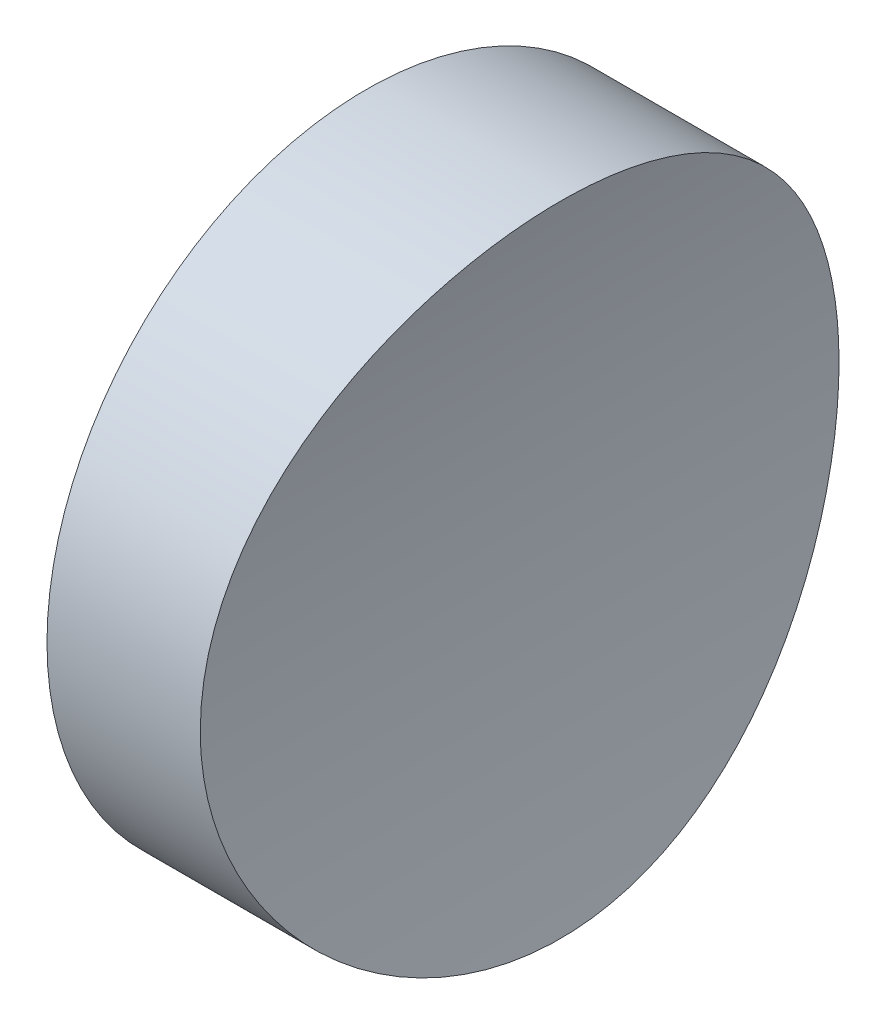
ISO-10303-21;
HEADER;
FILE_DESCRIPTION(('STEP AP214'),'2;1');
FILE_NAME('part.step','',(''),(''),'','','');
FILE_SCHEMA(('AUTOMOTIVE_DESIGN { 1 0 10303 214 1 1 1 1 }'));
ENDSEC;
DATA;
#1=APPLICATION_CONTEXT('core data for automotive mechanical design processes');
#2=APPLICATION_PROTOCOL_DEFINITION('international standard','automotive_design',2000,#1);
#3=PRODUCT_CONTEXT('',#1,'mechanical');
#4=PRODUCT('Part','Part','',(#3));
#5=PRODUCT_RELATED_PRODUCT_CATEGORY('part','',(#4));
#6=PRODUCT_DEFINITION_FORMATION('','',#4);
#7=PRODUCT_DEFINITION_CONTEXT('part definition',#1,'design');
#8=PRODUCT_DEFINITION('design','',#6,#7);
#9=PRODUCT_DEFINITION_SHAPE('','',#8);
#10=(LENGTH_UNIT() NAMED_UNIT(*) SI_UNIT(.MILLI.,.METRE.));
#11=(NAMED_UNIT(*) PLANE_ANGLE_UNIT() SI_UNIT($,.RADIAN.));
#12=(NAMED_UNIT(*) SI_UNIT($,.STERADIAN.) SOLID_ANGLE_UNIT());
#13=UNCERTAINTY_MEASURE_WITH_UNIT(LENGTH_MEASURE(1.E-05),#10,'distance_accuracy_value','');
#14=(GEOMETRIC_REPRESENTATION_CONTEXT(3) GLOBAL_UNCERTAINTY_ASSIGNED_CONTEXT((#13)) GLOBAL_UNIT_ASSIGNED_CONTEXT((#10,
#11,#12)) REPRESENTATION_CONTEXT('',''));
#15=CARTESIAN_POINT('',(0.,0.,0.));
#16=DIRECTION('',(0.,0.,1.));
#17=DIRECTION('',(1.,0.,0.));
#18=AXIS2_PLACEMENT_3D('',#15,#16,#17);
#19=CARTESIAN_POINT('',(10.,0.,0.));
#20=DIRECTION('',(-1.,0.,0.));
#21=DIRECTION('',(0.,0.,1.));
#22=AXIS2_PLACEMENT_3D('',#19,#20,#21);
#23=CYLINDRICAL_SURFACE('',#22,12.5);
#24=CARTESIAN_POINT('',(5.99999999999998,0.,12.5));
#25=CARTESIAN_POINT('',(6.00000081571526,0.345345858129955,12.499998542476));
#26=CARTESIAN_POINT('',(6.00358682191483,0.690720980627794,12.4856762712683));
#27=CARTESIAN_POINT('',(6.0178337178756,1.37897685436808,12.4285034438653));
#28=CARTESIAN_POINT('',(6.02849541484255,1.7218573165034,12.3856496327458));
#29=CARTESIAN_POINT('',(6.05660479370948,2.40280021913144,12.2717468283778));
#30=CARTESIAN_POINT('',(6.07405591791563,2.74086012527902,12.2006835322718));
#31=CARTESIAN_POINT('',(6.11526221735483,3.40956959119171,12.0309531087511));
#32=CARTESIAN_POINT('',(6.13901723144404,3.74021934014551,11.932286686941));
#33=CARTESIAN_POINT('',(6.19214986155646,4.39143160454447,11.7082770348339));
#34=CARTESIAN_POINT('',(6.22152060794816,4.71200589293533,11.5829663772143));
#35=CARTESIAN_POINT('',(6.28511099408943,5.34133409076771,11.3065586325392));
#36=CARTESIAN_POINT('',(6.31933065951727,5.65008793760106,11.1554614089257));
#37=CARTESIAN_POINT('',(6.39170415451126,6.25375145648697,10.8285920771972));
#38=CARTESIAN_POINT('',(6.42985792711309,6.54866132890482,10.6528203263462));
#39=CARTESIAN_POINT('',(6.50909045411966,7.1227706440562,10.2778258129714));
#40=CARTESIAN_POINT('',(6.55016933737079,7.40196939376919,10.0786020171701));
#41=CARTESIAN_POINT('',(6.6349442037592,7.94789184610699,9.65415754429416));
#42=CARTESIAN_POINT('',(6.67867452090326,8.21428968409248,9.42852450106898));
#43=CARTESIAN_POINT('',(6.76684843513978,8.7272289784513,8.95584237426211));
#44=CARTESIAN_POINT('',(6.81129204065602,8.97377020011486,8.70879303760655));
#45=CARTESIAN_POINT('',(6.89967618780297,9.44541093088348,8.19486829551772));
#46=CARTESIAN_POINT('',(6.94361666645053,9.67050778077715,7.92799043853142));
#47=CARTESIAN_POINT('',(7.02976701673763,10.097711498905,7.37617587363527));
#48=CARTESIAN_POINT('',(7.07197693308795,10.2998189613326,7.09123963276649));
#49=CARTESIAN_POINT('',(7.15408511333619,10.6824846765056,6.50077864948295));
#50=CARTESIAN_POINT('',(7.19393952525632,10.8626766877929,6.19501027061268));
#51=CARTESIAN_POINT('',(7.26946059783892,11.1965999199108,5.56884605054303));
#52=CARTESIAN_POINT('',(7.30512720563418,11.3503308067052,5.24845002475386));
#53=CARTESIAN_POINT('',(7.37118847932654,11.6301059024363,4.59530579606809));
#54=CARTESIAN_POINT('',(7.40158380092712,11.7561535554537,4.26255913574648));
#55=CARTESIAN_POINT('',(7.45616647580187,11.9795435842076,3.58707023733103));
#56=CARTESIAN_POINT('',(7.48035397777611,12.0768866475326,3.24432823888125));
#57=CARTESIAN_POINT('',(7.52134308881477,12.2403753433022,2.55832805448346));
#58=CARTESIAN_POINT('',(7.53828292669337,12.3071067781999,2.21521770157624));
#59=CARTESIAN_POINT('',(7.56494584700391,12.4116255097281,1.52433762999713));
#60=CARTESIAN_POINT('',(7.57466901692549,12.4494131572523,1.17656796786334));
#61=CARTESIAN_POINT('',(7.58659428826142,12.4957081162939,0.479005845104437));
#62=CARTESIAN_POINT('',(7.58879745752279,12.5042195850568,0.12921367874362));
#63=CARTESIAN_POINT('',(7.58561640729568,12.4918975051369,-0.56981600901988));
#64=CARTESIAN_POINT('',(7.58023229330772,12.4710643644883,-0.919053538067147));
#65=CARTESIAN_POINT('',(7.5622673007123,12.4011011342675,-1.60591279143432));
#66=CARTESIAN_POINT('',(7.54986430999014,12.3526702834176,-1.94361068244322));
#67=CARTESIAN_POINT('',(7.51836444125059,12.2284550484748,-2.61361187278367));
#68=CARTESIAN_POINT('',(7.49926768776225,12.1526711732496,-2.94591527235263));
#69=CARTESIAN_POINT('',(7.45493666995216,11.9743582368255,-3.60285956314226));
#70=CARTESIAN_POINT('',(7.42970210605493,11.8718278701608,-3.92750007950268));
#71=CARTESIAN_POINT('',(7.37381964363987,11.6408201249125,-4.56693246540194));
#72=CARTESIAN_POINT('',(7.34317165986572,11.5123423376766,-4.8817241797394));
#73=CARTESIAN_POINT('',(7.27699176787775,11.2289731703879,-5.50252257587502));
#74=CARTESIAN_POINT('',(7.24141376338958,11.0738287052328,-5.80840878938925));
#75=CARTESIAN_POINT('',(7.16661195870226,10.7391618403495,-6.4060680089994));
#76=CARTESIAN_POINT('',(7.12738814504062,10.5596393506019,-6.69784096297475));
#77=CARTESIAN_POINT('',(7.04636692306731,10.1774241513362,-7.26547516607328));
#78=CARTESIAN_POINT('',(7.00456913925823,9.97472805748094,-7.54133408219258));
#79=CARTESIAN_POINT('',(6.91953341842233,9.54752439698663,-8.07537681044579));
#80=CARTESIAN_POINT('',(6.87629545355465,9.32301640852998,-8.33356028059175));
#81=CARTESIAN_POINT('',(6.78829171801662,8.84692110492471,-8.83773744641804));
#82=CARTESIAN_POINT('',(6.74351756411468,8.59474378950227,-9.08317289987925));
#83=CARTESIAN_POINT('',(6.65491293081792,8.07050421758106,-9.551995703129));
#84=CARTESIAN_POINT('',(6.61108246987495,7.79844157272413,-9.77538262211187));
#85=CARTESIAN_POINT('',(6.52558221368867,7.23621606208977,-10.1985771706933));
#86=CARTESIAN_POINT('',(6.48391250306027,6.94605248845918,-10.3983838772818));
#87=CARTESIAN_POINT('',(6.4038956615231,6.34956444270317,-10.772978157784));
#88=CARTESIAN_POINT('',(6.3655485103532,6.04324006914541,-10.947765884269));
#89=CARTESIAN_POINT('',(6.2931243100662,5.41541235056755,-11.2715789798304));
#90=CARTESIAN_POINT('',(6.25906253004677,5.09386005140018,-11.4205129077416));
#91=CARTESIAN_POINT('',(6.19633357277247,4.43881192206135,-11.6907000644577));
#92=CARTESIAN_POINT('',(6.16766642582519,4.10531602480211,-11.8119531377496));
#93=CARTESIAN_POINT('',(6.11655467999221,3.42883552948264,-12.0257598474396));
#94=CARTESIAN_POINT('',(6.09410911269256,3.08585241729649,-12.1183179505915));
#95=CARTESIAN_POINT('',(6.05608680584867,2.39289058593558,-12.2739631052046));
#96=CARTESIAN_POINT('',(6.04050989696111,2.04291203945215,-12.3370508832442));
#97=CARTESIAN_POINT('',(6.01698513491397,1.34763092374324,-12.4319680906689));
#98=CARTESIAN_POINT('',(6.00885216046332,1.00243806174492,-12.4645564950301));
#99=CARTESIAN_POINT('',(5.99976653673325,0.310446227793141,-12.5009464008154));
#100=CARTESIAN_POINT('',(5.99881376495821,-0.0363527166592359,-12.5047483933412));
#101=CARTESIAN_POINT('',(6.00411496567777,-0.72898221080777,-12.4835341096494));
#102=CARTESIAN_POINT('',(6.01036834064533,-1.07481283841245,-12.458520222818));
#103=CARTESIAN_POINT('',(6.02990580468649,-1.76300446713083,-12.3798934330572));
#104=CARTESIAN_POINT('',(6.04318986627077,-2.10536548180506,-12.3262806419468));
#105=CARTESIAN_POINT('',(6.07617113727906,-2.77909750176338,-12.1919176524651));
#106=CARTESIAN_POINT('',(6.09577015058952,-3.11055621416769,-12.1115824000743));
#107=CARTESIAN_POINT('',(6.14090559926788,-3.76542622915844,-11.9242422256603));
#108=CARTESIAN_POINT('',(6.16644195797631,-4.08883763558724,-11.8172376479743));
#109=CARTESIAN_POINT('',(6.22277602725349,-4.72547495684811,-11.5773748413572));
#110=CARTESIAN_POINT('',(6.25357412556555,-5.03870011901852,-11.4445147070017));
#111=CARTESIAN_POINT('',(6.31962082142066,-5.65290579173548,-11.1539268996522));
#112=CARTESIAN_POINT('',(6.3548695011266,-5.95388607609178,-10.996198767553));
#113=CARTESIAN_POINT('',(6.4295561565498,-6.54690733138469,-10.6539790694276));
#114=CARTESIAN_POINT('',(6.46905735166861,-6.83869503605042,-10.4690623992547));
#115=CARTESIAN_POINT('',(6.55066028924347,-7.40573208883362,-10.075919856371));
#116=CARTESIAN_POINT('',(6.59276205693865,-7.68098127638992,-9.86769375742107));
#117=CARTESIAN_POINT('',(6.67844828018092,-8.21323439402229,-9.42929844928364));
#118=CARTESIAN_POINT('',(6.72203296020064,-8.47023554350212,-9.19912590841092));
#119=CARTESIAN_POINT('',(6.80951322579715,-8.96431645792168,-8.71836265750537));
#120=CARTESIAN_POINT('',(6.85340881488648,-9.20139599740279,-8.46777171645481));
#121=CARTESIAN_POINT('',(6.94139799399648,-9.65967669367524,-7.94137233363743));
#122=CARTESIAN_POINT('',(6.98546992868595,-9.8803443006733,-7.66509543686493));
#123=CARTESIAN_POINT('',(7.07143892969173,-10.2976362133889,-7.09461670037542));
#124=CARTESIAN_POINT('',(7.11333595631091,-10.494260080341,-6.8004145336935));
#125=CARTESIAN_POINT('',(7.19373479083822,-10.8620404955946,-6.19606290103677));
#126=CARTESIAN_POINT('',(7.23223667826019,-11.0331976403887,-5.88591380880689));
#127=CARTESIAN_POINT('',(7.3047025760101,-11.3487546890229,-5.25177939598629));
#128=CARTESIAN_POINT('',(7.33866664946515,-11.493154965098,-4.92779426795627));
#129=CARTESIAN_POINT('',(7.40083929542536,-11.7532704940522,-4.27023312528235));
#130=CARTESIAN_POINT('',(7.42908117765517,-11.8691526557657,-3.93672631797506));
#131=CARTESIAN_POINT('',(7.4791975052135,-12.0723939041458,-3.26065850705788));
#132=CARTESIAN_POINT('',(7.50107195946589,-12.1597530307871,-2.91809751613804));
#133=CARTESIAN_POINT('',(7.53776609513861,-12.3051825749983,-2.22650410200567));
#134=CARTESIAN_POINT('',(7.55258707103971,-12.363258366872,-1.87747287845977));
#135=CARTESIAN_POINT('',(7.57470929351593,-12.4496272042819,-1.17551084786422));
#136=CARTESIAN_POINT('',(7.58201072100792,-12.4779209663603,-0.822580134840995));
#137=CARTESIAN_POINT('',(7.58876272518206,-12.5040902755747,-0.125690563470842));
#138=CARTESIAN_POINT('',(7.5884329957858,-12.5028170258756,0.218234490431442));
#139=CARTESIAN_POINT('',(7.58047164049161,-12.4719496530419,0.904721133720535));
#140=CARTESIAN_POINT('',(7.57284016234521,-12.4423561029709,1.24728275055577));
#141=CARTESIAN_POINT('',(7.55050621633596,-12.3551031042829,1.92856624844879));
#142=CARTESIAN_POINT('',(7.53580393649118,-12.2974444019395,2.26728823136028));
#143=CARTESIAN_POINT('',(7.49976833730183,-12.1545443869924,2.93850126361318));
#144=CARTESIAN_POINT('',(7.47843498471599,-12.0693029361175,3.2709922817102));
#145=CARTESIAN_POINT('',(7.42991206645613,-11.872520891633,3.92547045749319));
#146=CARTESIAN_POINT('',(7.40275833107813,-11.7611408263901,4.24750858869969));
#147=CARTESIAN_POINT('',(7.34329675989242,-11.512668480082,4.88100719240879));
#148=CARTESIAN_POINT('',(7.31098896101167,-11.3755763832328,5.19246774067648));
#149=CARTESIAN_POINT('',(7.24211968532036,-11.0766699521319,5.80283282354663));
#150=CARTESIAN_POINT('',(7.20555779746464,-10.9148532284252,6.1017361410208));
#151=CARTESIAN_POINT('',(7.12918322582309,-10.567632405847,6.68508562882951));
#152=CARTESIAN_POINT('',(7.08937040800286,-10.3822273342624,6.96953120229244));
#153=CARTESIAN_POINT('',(7.00649618726664,-9.98393796386293,7.52941321165712));
#154=CARTESIAN_POINT('',(6.96337713500564,-9.77046302819968,7.80442110523206));
#155=CARTESIAN_POINT('',(6.87604107072134,-9.32142482529095,8.33558565405774));
#156=CARTESIAN_POINT('',(6.83182403911286,-9.08586116383034,8.59174197272076));
#157=CARTESIAN_POINT('',(6.74350537425833,-8.59419030433725,9.0835452974473));
#158=CARTESIAN_POINT('',(6.69940374245358,-8.33808285097161,9.31919204852711));
#159=CARTESIAN_POINT('',(6.61249908626096,-7.80686919956302,9.76851402919657));
#160=CARTESIAN_POINT('',(6.56969663457236,-7.53175479311293,9.98217966554263));
#161=CARTESIAN_POINT('',(6.48581888110867,-6.95924298273733,10.3896396759224));
#162=CARTESIAN_POINT('',(6.44478908380965,-6.66153155922842,10.5830025235865));
#163=CARTESIAN_POINT('',(6.36648149411774,-6.05050823274959,10.9438189871761));
#164=CARTESIAN_POINT('',(6.32920203316949,-5.73720336100236,11.1112841431721));
#165=CARTESIAN_POINT('',(6.25944836751581,-5.09716652663357,11.4190604869767));
#166=CARTESIAN_POINT('',(6.22697227968576,-4.7704398904413,11.5593823227875));
#167=CARTESIAN_POINT('',(6.16774393866742,-4.10578919609508,11.8118084302427));
#168=CARTESIAN_POINT('',(6.14099082211563,-3.7678668358159,11.9239169585779));
#169=CARTESIAN_POINT('',(6.09841212026126,-3.14787089764561,12.1005925818354));
#170=CARTESIAN_POINT('',(6.08147725793302,-2.86728001520345,12.1701379933195));
#171=CARTESIAN_POINT('',(6.05220539305691,-2.30172947899819,12.2896522930125));
#172=CARTESIAN_POINT('',(6.03986806976469,-2.01677013144286,12.339622546882));
#173=CARTESIAN_POINT('',(6.02003029288133,-1.44387788843724,12.4196972192842));
#174=CARTESIAN_POINT('',(6.01253030510685,-1.15594470933018,12.4497997246361));
#175=CARTESIAN_POINT('',(6.00251545766746,-0.578680949140916,12.4899491478882));
#176=CARTESIAN_POINT('',(5.9999993165465,-0.289350746448699,12.500001221198));
#177=CARTESIAN_POINT('',(5.99999999999998,0.,12.5));
#178=B_SPLINE_CURVE_WITH_KNOTS('',3,(#24,#25,#26,#27,#28,#29,#30,#31,#32,#33,#34,#35,#36,#37,
#38,#39,#40,#41,#42,#43,#44,#45,#46,#47,#48,#49,#50,#51,#52,#53,#54,#55,#56,#57,#58,#59,#60,#61,
#62,#63,#64,#65,#66,#67,#68,#69,#70,#71,#72,#73,#74,#75,#76,#77,#78,#79,#80,#81,#82,#83,#84,#85,
#86,#87,#88,#89,#90,#91,#92,#93,#94,#95,#96,#97,#98,#99,#100,#101,#102,#103,#104,#105,#106,#107,
#108,#109,#110,#111,#112,#113,#114,#115,#116,#117,#118,#119,#120,#121,#122,#123,#124,#125,#126,
#127,#128,#129,#130,#131,#132,#133,#134,#135,#136,#137,#138,#139,#140,#141,#142,#143,#144,#145,
#146,#147,#148,#149,#150,#151,#152,#153,#154,#155,#156,#157,#158,#159,#160,#161,#162,#163,#164,
#165,#166,#167,#168,#169,#170,#171,#172,#173,#174,#175,#176,#177),.UNSPECIFIED.,.T.,.F.,(4,2,2,
2,2,2,2,2,2,2,2,2,2,2,2,2,2,2,2,2,2,2,2,2,2,2,2,2,2,2,2,2,2,2,2,2,2,2,2,2,2,2,2,2,2,2,2,2,2,2,2,
2,2,2,2,2,2,2,2,2,2,2,2,2,2,2,2,2,2,2,2,2,2,2,2,2,4),(0.,1.03577386168253,2.0716659063673,
3.10808384435617,4.1444752913513,5.17960695669381,6.21474410395866,7.24986626495347,
8.2850340496454,9.33933066742181,10.3936397453979,11.4480793933577,12.5024917816352,
13.5726259410068,14.6427736083933,15.7127880628206,16.7827768840836,17.8313349253048,
18.879880254364,19.928276682827,20.97665853357,21.9995889895184,23.0225004161404,
24.0454617792483,25.0684392544812,26.1017236302133,27.1350118215961,28.1684511104691,
29.2019103888785,30.2648664166191,31.3278432093162,32.3908615967694,33.4538735014281,
34.520571739592,35.5872759703926,36.6538140710205,37.7203258752158,38.7595309263662,
39.7987182484387,40.8378194082581,41.8769165053203,42.9005782126277,43.9242267037567,
44.9479506612139,45.9716935205623,47.0135955987419,48.0555077904033,49.0975784071608,
50.1396608157438,51.2073584154887,52.2750754963473,53.3427675647283,54.4104447785245,
55.4717160437128,56.5329858215357,57.5940607559716,58.6551101608368,59.6856519612318,
60.7161729089662,61.7466664558696,62.777165168673,63.8014935316577,64.8258145560391,
65.8502346362694,66.8746969742307,67.9258821743524,68.9770861384359,70.0283031696703,
71.0799770556584,72.1507569661663,73.2210583512334,74.2909390144763,75.3606581622632,
76.22868967188,77.0966606124975,77.9647151228769,78.8325464084547),.UNSPECIFIED.);
#179=CARTESIAN_POINT('',(5.99999999999998,0.,12.5));
#180=VERTEX_POINT('',#179);
#181=EDGE_CURVE('E10',#180,#180,#178,.T.);
#182=ORIENTED_EDGE('',*,*,#181,.T.);
#183=EDGE_LOOP('',(#182));
#184=FACE_BOUND('',#183,.T.);
#185=CARTESIAN_POINT('',(0.,0.,0.));
#186=DIRECTION('',(1.,0.,0.));
#187=DIRECTION('',(0.,0.,-1.));
#188=AXIS2_PLACEMENT_3D('',#185,#186,#187);
#189=CIRCLE('',#188,12.5);
#190=CARTESIAN_POINT('',(0.,0.,-12.5));
#191=VERTEX_POINT('',#190);
#192=EDGE_CURVE('E46',#191,#191,#189,.T.);
#193=ORIENTED_EDGE('',*,*,#192,.T.);
#194=EDGE_LOOP('',(#193));
#195=FACE_BOUND('',#194,.T.);
#196=ADVANCED_FACE('F35',(#184,#195),#23,.T.);
#197=CARTESIAN_POINT('',(0.,0.,0.));
#198=DIRECTION('',(1.,0.,0.));
#199=DIRECTION('',(0.,0.,-1.));
#200=AXIS2_PLACEMENT_3D('',#197,#198,#199);
#201=PLANE('',#200);
#202=ORIENTED_EDGE('',*,*,#192,.F.);
#203=EDGE_LOOP('',(#202));
#204=FACE_BOUND('',#203,.T.);
#205=ADVANCED_FACE('F53',(#204),#201,.F.);
#206=CARTESIAN_POINT('',(56.,0.,-12.5));
#207=DIRECTION('',(0.,0.,1.));
#208=DIRECTION('',(1.,0.,0.));
#209=AXIS2_PLACEMENT_3D('',#206,#207,#208);
#210=CYLINDRICAL_SURFACE('',#209,50.);
#211=ORIENTED_EDGE('',*,*,#181,.F.);
#212=EDGE_LOOP('',(#211));
#213=FACE_BOUND('',#212,.T.);
#214=ADVANCED_FACE('F55',(#213),#210,.F.);
#215=CLOSED_SHELL('',(#196,#205,#214));
#216=MANIFOLD_SOLID_BREP('B2',#215);
#217=ADVANCED_BREP_SHAPE_REPRESENTATION('',(#18,#216),#14);
#218=SHAPE_DEFINITION_REPRESENTATION(#9,#217);
ENDSEC;
END-ISO-10303-21;
